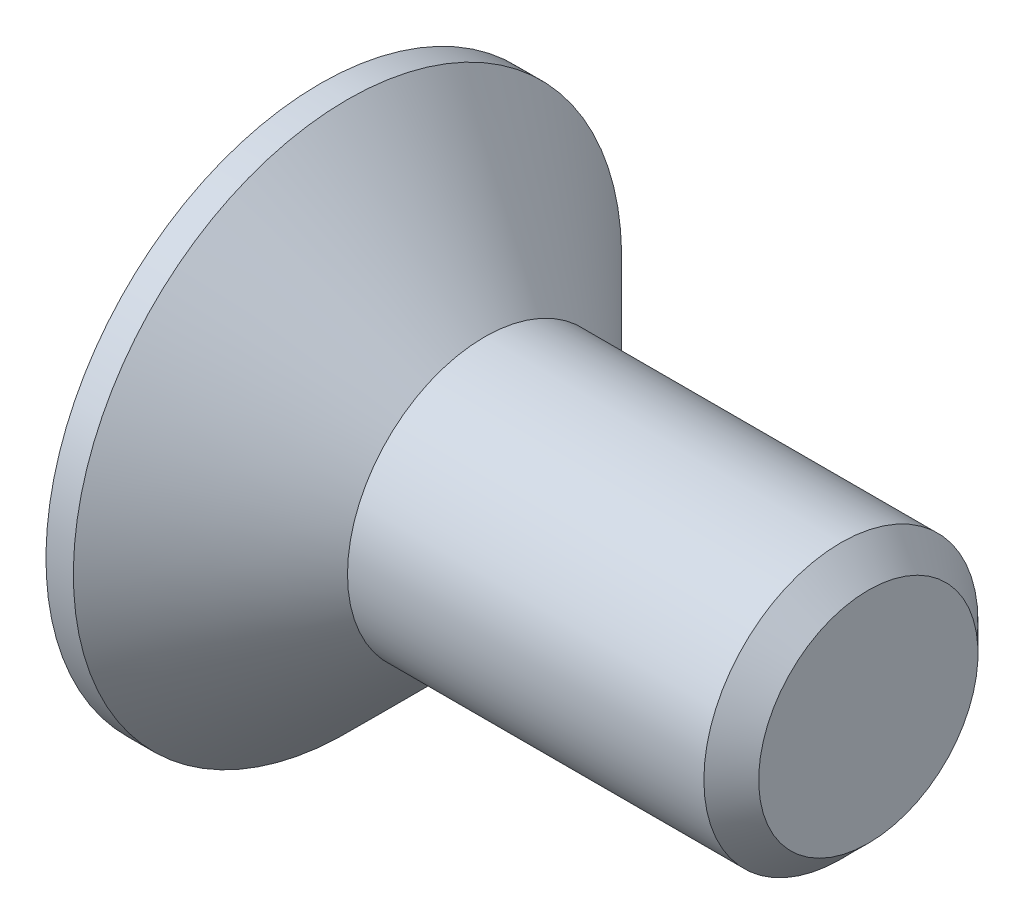
ISO-10303-21;
HEADER;
FILE_DESCRIPTION(('STEP AP214'),'2;1');
FILE_NAME('part.step','',(''),(''),'','','');
FILE_SCHEMA(('AUTOMOTIVE_DESIGN { 1 0 10303 214 1 1 1 1 }'));
ENDSEC;
DATA;
#1=APPLICATION_CONTEXT('core data for automotive mechanical design processes');
#2=APPLICATION_PROTOCOL_DEFINITION('international standard','automotive_design',2000,#1);
#3=PRODUCT_CONTEXT('',#1,'mechanical');
#4=PRODUCT('Part','Part','',(#3));
#5=PRODUCT_RELATED_PRODUCT_CATEGORY('part','',(#4));
#6=PRODUCT_DEFINITION_FORMATION('','',#4);
#7=PRODUCT_DEFINITION_CONTEXT('part definition',#1,'design');
#8=PRODUCT_DEFINITION('design','',#6,#7);
#9=PRODUCT_DEFINITION_SHAPE('','',#8);
#10=(LENGTH_UNIT() NAMED_UNIT(*) SI_UNIT(.MILLI.,.METRE.));
#11=(NAMED_UNIT(*) PLANE_ANGLE_UNIT() SI_UNIT($,.RADIAN.));
#12=(NAMED_UNIT(*) SI_UNIT($,.STERADIAN.) SOLID_ANGLE_UNIT());
#13=UNCERTAINTY_MEASURE_WITH_UNIT(LENGTH_MEASURE(1.E-05),#10,'distance_accuracy_value','');
#14=(GEOMETRIC_REPRESENTATION_CONTEXT(3) GLOBAL_UNCERTAINTY_ASSIGNED_CONTEXT((#13)) GLOBAL_UNIT_ASSIGNED_CONTEXT((#10,
#11,#12)) REPRESENTATION_CONTEXT('',''));
#15=CARTESIAN_POINT('',(0.,0.,0.));
#16=DIRECTION('',(0.,0.,1.));
#17=DIRECTION('',(1.,0.,0.));
#18=AXIS2_PLACEMENT_3D('',#15,#16,#17);
#19=CARTESIAN_POINT('',(0.,0.,0.));
#20=DIRECTION('',(-1.,0.,0.));
#21=DIRECTION('',(0.,-1.,0.));
#22=AXIS2_PLACEMENT_3D('',#19,#20,#21);
#23=PLANE('',#22);
#24=DIRECTION('',(0.,0.5,-0.866025403784439));
#25=VECTOR('',#24,1.);
#26=CARTESIAN_POINT('',(0.,0.866025403784439,1.5));
#27=LINE('',#26,#25);
#28=CARTESIAN_POINT('',(0.,0.866025403784439,1.5));
#29=VERTEX_POINT('',#28);
#30=CARTESIAN_POINT('',(0.,1.73205080756888,0.));
#31=VERTEX_POINT('',#30);
#32=EDGE_CURVE('E48',#29,#31,#27,.T.);
#33=ORIENTED_EDGE('',*,*,#32,.F.);
#34=DIRECTION('',(0.,1.,0.));
#35=VECTOR('',#34,1.);
#36=CARTESIAN_POINT('',(0.,-0.86602540378444,1.5));
#37=LINE('',#36,#35);
#38=CARTESIAN_POINT('',(0.,-0.86602540378444,1.5));
#39=VERTEX_POINT('',#38);
#40=EDGE_CURVE('E131',#39,#29,#37,.T.);
#41=ORIENTED_EDGE('',*,*,#40,.F.);
#42=DIRECTION('',(0.,0.5,0.866025403784439));
#43=VECTOR('',#42,1.);
#44=CARTESIAN_POINT('',(0.,-1.73205080756888,0.));
#45=LINE('',#44,#43);
#46=CARTESIAN_POINT('',(0.,-1.73205080756888,0.));
#47=VERTEX_POINT('',#46);
#48=EDGE_CURVE('E129',#47,#39,#45,.T.);
#49=ORIENTED_EDGE('',*,*,#48,.F.);
#50=DIRECTION('',(0.,-0.5,0.866025403784438));
#51=VECTOR('',#50,1.);
#52=CARTESIAN_POINT('',(0.,-0.866025403784439,-1.5));
#53=LINE('',#52,#51);
#54=CARTESIAN_POINT('',(0.,-0.866025403784439,-1.5));
#55=VERTEX_POINT('',#54);
#56=EDGE_CURVE('E96',#55,#47,#53,.T.);
#57=ORIENTED_EDGE('',*,*,#56,.F.);
#58=DIRECTION('',(0.,-1.,0.));
#59=VECTOR('',#58,1.);
#60=CARTESIAN_POINT('',(0.,0.866025403784439,-1.5));
#61=LINE('',#60,#59);
#62=CARTESIAN_POINT('',(0.,0.866025403784439,-1.5));
#63=VERTEX_POINT('',#62);
#64=EDGE_CURVE('E125',#63,#55,#61,.T.);
#65=ORIENTED_EDGE('',*,*,#64,.F.);
#66=DIRECTION('',(0.,-0.5,-0.866025403784439));
#67=VECTOR('',#66,1.);
#68=CARTESIAN_POINT('',(0.,1.73205080756888,0.));
#69=LINE('',#68,#67);
#70=EDGE_CURVE('E122',#31,#63,#69,.T.);
#71=ORIENTED_EDGE('',*,*,#70,.F.);
#72=EDGE_LOOP('',(#33,#41,#49,#57,#65,#71));
#73=FACE_BOUND('',#72,.T.);
#74=CARTESIAN_POINT('',(0.,0.,0.));
#75=DIRECTION('',(1.,0.,0.));
#76=DIRECTION('',(0.,1.,0.));
#77=AXIS2_PLACEMENT_3D('',#74,#75,#76);
#78=CIRCLE('',#77,5.);
#79=CARTESIAN_POINT('',(0.,5.,0.));
#80=VERTEX_POINT('',#79);
#81=EDGE_CURVE('E146',#80,#80,#78,.T.);
#82=ORIENTED_EDGE('',*,*,#81,.F.);
#83=EDGE_LOOP('',(#82));
#84=FACE_BOUND('',#83,.T.);
#85=ADVANCED_FACE('F33',(#73,#84),#23,.T.);
#86=CARTESIAN_POINT('',(10.,0.,0.));
#87=DIRECTION('',(1.,0.,0.));
#88=DIRECTION('',(0.,1.,0.));
#89=AXIS2_PLACEMENT_3D('',#86,#87,#88);
#90=CYLINDRICAL_SURFACE('',#89,5.);
#91=ORIENTED_EDGE('',*,*,#81,.T.);
#92=EDGE_LOOP('',(#91));
#93=FACE_BOUND('',#92,.T.);
#94=CARTESIAN_POINT('',(0.499999999999938,0.,0.));
#95=DIRECTION('',(1.,0.,0.));
#96=DIRECTION('',(0.,1.,0.));
#97=AXIS2_PLACEMENT_3D('',#94,#95,#96);
#98=CIRCLE('',#97,5.);
#99=CARTESIAN_POINT('',(0.49999999999994,5.,0.));
#100=VERTEX_POINT('',#99);
#101=EDGE_CURVE('E143',#100,#100,#98,.T.);
#102=ORIENTED_EDGE('',*,*,#101,.F.);
#103=EDGE_LOOP('',(#102));
#104=FACE_BOUND('',#103,.T.);
#105=ADVANCED_FACE('F166',(#93,#104),#90,.T.);
#106=CARTESIAN_POINT('',(3.,0.,0.));
#107=DIRECTION('',(-1.,0.,0.));
#108=DIRECTION('',(0.,-1.,0.));
#109=AXIS2_PLACEMENT_3D('',#106,#107,#108);
#110=CONICAL_SURFACE('',#109,2.5,0.785398163397436);
#111=ORIENTED_EDGE('',*,*,#101,.T.);
#112=EDGE_LOOP('',(#111));
#113=FACE_BOUND('',#112,.T.);
#114=CARTESIAN_POINT('',(3.,0.,0.));
#115=DIRECTION('',(1.,0.,0.));
#116=DIRECTION('',(0.,1.,0.));
#117=AXIS2_PLACEMENT_3D('',#114,#115,#116);
#118=CIRCLE('',#117,2.5);
#119=CARTESIAN_POINT('',(3.,2.5,0.));
#120=VERTEX_POINT('',#119);
#121=EDGE_CURVE('E135',#120,#120,#118,.T.);
#122=ORIENTED_EDGE('',*,*,#121,.F.);
#123=EDGE_LOOP('',(#122));
#124=FACE_BOUND('',#123,.T.);
#125=ADVANCED_FACE('F171',(#113,#124),#110,.T.);
#126=CARTESIAN_POINT('',(10.,0.,0.));
#127=DIRECTION('',(1.,0.,0.));
#128=DIRECTION('',(0.,1.,0.));
#129=AXIS2_PLACEMENT_3D('',#126,#127,#128);
#130=CYLINDRICAL_SURFACE('',#129,2.5);
#131=CARTESIAN_POINT('',(9.5,0.,0.));
#132=DIRECTION('',(1.,0.,0.));
#133=DIRECTION('',(0.,1.,0.));
#134=AXIS2_PLACEMENT_3D('',#131,#132,#133);
#135=CIRCLE('',#134,2.5);
#136=CARTESIAN_POINT('',(9.5,2.5,0.));
#137=VERTEX_POINT('',#136);
#138=EDGE_CURVE('E11',#137,#137,#135,.F.);
#139=ORIENTED_EDGE('',*,*,#138,.T.);
#140=EDGE_LOOP('',(#139));
#141=FACE_BOUND('',#140,.T.);
#142=ORIENTED_EDGE('',*,*,#121,.T.);
#143=EDGE_LOOP('',(#142));
#144=FACE_BOUND('',#143,.T.);
#145=ADVANCED_FACE('F162',(#141,#144),#130,.T.);
#146=CARTESIAN_POINT('',(10.,2.5,0.));
#147=DIRECTION('',(1.,0.,0.));
#148=DIRECTION('',(0.,1.,0.));
#149=AXIS2_PLACEMENT_3D('',#146,#147,#148);
#150=PLANE('',#149);
#151=CARTESIAN_POINT('',(10.,0.,0.));
#152=DIRECTION('',(1.,0.,0.));
#153=DIRECTION('',(0.,1.,0.));
#154=AXIS2_PLACEMENT_3D('',#151,#152,#153);
#155=CIRCLE('',#154,1.99999999999999);
#156=CARTESIAN_POINT('',(10.,1.99999999999999,0.));
#157=VERTEX_POINT('',#156);
#158=EDGE_CURVE('E41',#157,#157,#155,.T.);
#159=ORIENTED_EDGE('',*,*,#158,.T.);
#160=EDGE_LOOP('',(#159));
#161=FACE_BOUND('',#160,.T.);
#162=ADVANCED_FACE('F151',(#161),#150,.T.);
#163=CARTESIAN_POINT('',(10.,0.,0.));
#164=DIRECTION('',(-1.,0.,0.));
#165=DIRECTION('',(0.,-1.,0.));
#166=AXIS2_PLACEMENT_3D('',#163,#164,#165);
#167=CONICAL_SURFACE('',#166,1.99999999999999,0.785398163397448);
#168=ORIENTED_EDGE('',*,*,#138,.F.);
#169=EDGE_LOOP('',(#168));
#170=FACE_BOUND('',#169,.T.);
#171=ORIENTED_EDGE('',*,*,#158,.F.);
#172=EDGE_LOOP('',(#171));
#173=FACE_BOUND('',#172,.T.);
#174=ADVANCED_FACE('F35',(#170,#173),#167,.T.);
#175=CARTESIAN_POINT('',(2.3,0.866025403784438,1.5));
#176=DIRECTION('',(0.,0.866025403784439,0.5));
#177=DIRECTION('',(0.,-0.5,0.866025403784439));
#178=AXIS2_PLACEMENT_3D('',#175,#176,#177);
#179=PLANE('',#178);
#180=ORIENTED_EDGE('',*,*,#32,.T.);
#181=DIRECTION('',(-1.,0.,0.));
#182=VECTOR('',#181,1.);
#183=CARTESIAN_POINT('',(2.3,1.73205080756888,0.));
#184=LINE('',#183,#182);
#185=CARTESIAN_POINT('',(2.3,1.73205080756888,0.));
#186=VERTEX_POINT('',#185);
#187=EDGE_CURVE('E78',#186,#31,#184,.T.);
#188=ORIENTED_EDGE('',*,*,#187,.F.);
#189=DIRECTION('',(0.,0.5,-0.866025403784439));
#190=VECTOR('',#189,1.);
#191=CARTESIAN_POINT('',(2.3,0.866025403784438,1.5));
#192=LINE('',#191,#190);
#193=CARTESIAN_POINT('',(2.3,0.866025403784438,1.5));
#194=VERTEX_POINT('',#193);
#195=EDGE_CURVE('E133',#194,#186,#192,.T.);
#196=ORIENTED_EDGE('',*,*,#195,.F.);
#197=DIRECTION('',(-1.,0.,0.));
#198=VECTOR('',#197,1.);
#199=CARTESIAN_POINT('',(2.3,0.866025403784438,1.5));
#200=LINE('',#199,#198);
#201=EDGE_CURVE('E56',#194,#29,#200,.T.);
#202=ORIENTED_EDGE('',*,*,#201,.T.);
#203=EDGE_LOOP('',(#180,#188,#196,#202));
#204=FACE_BOUND('',#203,.T.);
#205=ADVANCED_FACE('F154',(#204),#179,.F.);
#206=CARTESIAN_POINT('',(2.3,-0.86602540378444,1.5));
#207=DIRECTION('',(0.,0.,1.));
#208=DIRECTION('',(0.,-1.,0.));
#209=AXIS2_PLACEMENT_3D('',#206,#207,#208);
#210=PLANE('',#209);
#211=ORIENTED_EDGE('',*,*,#40,.T.);
#212=ORIENTED_EDGE('',*,*,#201,.F.);
#213=DIRECTION('',(0.,1.,0.));
#214=VECTOR('',#213,1.);
#215=CARTESIAN_POINT('',(2.3,-0.86602540378444,1.5));
#216=LINE('',#215,#214);
#217=CARTESIAN_POINT('',(2.3,-0.86602540378444,1.5));
#218=VERTEX_POINT('',#217);
#219=EDGE_CURVE('E108',#218,#194,#216,.T.);
#220=ORIENTED_EDGE('',*,*,#219,.F.);
#221=DIRECTION('',(-1.,0.,0.));
#222=VECTOR('',#221,1.);
#223=CARTESIAN_POINT('',(2.3,-0.86602540378444,1.5));
#224=LINE('',#223,#222);
#225=EDGE_CURVE('E100',#218,#39,#224,.T.);
#226=ORIENTED_EDGE('',*,*,#225,.T.);
#227=EDGE_LOOP('',(#211,#212,#220,#226));
#228=FACE_BOUND('',#227,.T.);
#229=ADVANCED_FACE('F160',(#228),#210,.F.);
#230=CARTESIAN_POINT('',(2.3,-1.73205080756888,0.));
#231=DIRECTION('',(0.,-0.866025403784439,0.5));
#232=DIRECTION('',(0.,-0.5,-0.866025403784439));
#233=AXIS2_PLACEMENT_3D('',#230,#231,#232);
#234=PLANE('',#233);
#235=ORIENTED_EDGE('',*,*,#48,.T.);
#236=ORIENTED_EDGE('',*,*,#225,.F.);
#237=DIRECTION('',(0.,0.5,0.866025403784439));
#238=VECTOR('',#237,1.);
#239=CARTESIAN_POINT('',(2.3,-1.73205080756888,0.));
#240=LINE('',#239,#238);
#241=CARTESIAN_POINT('',(2.3,-1.73205080756888,0.));
#242=VERTEX_POINT('',#241);
#243=EDGE_CURVE('E104',#242,#218,#240,.T.);
#244=ORIENTED_EDGE('',*,*,#243,.F.);
#245=DIRECTION('',(-1.,0.,0.));
#246=VECTOR('',#245,1.);
#247=CARTESIAN_POINT('',(2.3,-1.73205080756888,0.));
#248=LINE('',#247,#246);
#249=EDGE_CURVE('E89',#242,#47,#248,.T.);
#250=ORIENTED_EDGE('',*,*,#249,.T.);
#251=EDGE_LOOP('',(#235,#236,#244,#250));
#252=FACE_BOUND('',#251,.T.);
#253=ADVANCED_FACE('F105',(#252),#234,.F.);
#254=CARTESIAN_POINT('',(2.3,-0.866025403784439,-1.5));
#255=DIRECTION('',(0.,-0.866025403784439,-0.5));
#256=DIRECTION('',(0.,0.5,-0.866025403784439));
#257=AXIS2_PLACEMENT_3D('',#254,#255,#256);
#258=PLANE('',#257);
#259=ORIENTED_EDGE('',*,*,#56,.T.);
#260=ORIENTED_EDGE('',*,*,#249,.F.);
#261=DIRECTION('',(0.,-0.5,0.866025403784438));
#262=VECTOR('',#261,1.);
#263=CARTESIAN_POINT('',(2.3,-0.866025403784439,-1.5));
#264=LINE('',#263,#262);
#265=CARTESIAN_POINT('',(2.3,-0.866025403784439,-1.5));
#266=VERTEX_POINT('',#265);
#267=EDGE_CURVE('E93',#266,#242,#264,.T.);
#268=ORIENTED_EDGE('',*,*,#267,.F.);
#269=DIRECTION('',(-1.,0.,0.));
#270=VECTOR('',#269,1.);
#271=CARTESIAN_POINT('',(2.3,-0.866025403784439,-1.5));
#272=LINE('',#271,#270);
#273=EDGE_CURVE('E101',#266,#55,#272,.T.);
#274=ORIENTED_EDGE('',*,*,#273,.T.);
#275=EDGE_LOOP('',(#259,#260,#268,#274));
#276=FACE_BOUND('',#275,.T.);
#277=ADVANCED_FACE('F91',(#276),#258,.F.);
#278=CARTESIAN_POINT('',(2.3,0.866025403784438,-1.5));
#279=DIRECTION('',(0.,0.,-1.));
#280=DIRECTION('',(-1.,0.,0.));
#281=AXIS2_PLACEMENT_3D('',#278,#279,#280);
#282=PLANE('',#281);
#283=ORIENTED_EDGE('',*,*,#64,.T.);
#284=ORIENTED_EDGE('',*,*,#273,.F.);
#285=DIRECTION('',(0.,-1.,0.));
#286=VECTOR('',#285,1.);
#287=CARTESIAN_POINT('',(2.3,0.866025403784438,-1.5));
#288=LINE('',#287,#286);
#289=CARTESIAN_POINT('',(2.3,0.866025403784438,-1.5));
#290=VERTEX_POINT('',#289);
#291=EDGE_CURVE('E114',#290,#266,#288,.T.);
#292=ORIENTED_EDGE('',*,*,#291,.F.);
#293=DIRECTION('',(-1.,0.,0.));
#294=VECTOR('',#293,1.);
#295=CARTESIAN_POINT('',(2.3,0.866025403784438,-1.5));
#296=LINE('',#295,#294);
#297=EDGE_CURVE('E138',#290,#63,#296,.T.);
#298=ORIENTED_EDGE('',*,*,#297,.T.);
#299=EDGE_LOOP('',(#283,#284,#292,#298));
#300=FACE_BOUND('',#299,.T.);
#301=ADVANCED_FACE('F185',(#300),#282,.F.);
#302=CARTESIAN_POINT('',(2.3,1.73205080756888,0.));
#303=DIRECTION('',(0.,0.866025403784439,-0.5));
#304=DIRECTION('',(0.,0.5,0.866025403784439));
#305=AXIS2_PLACEMENT_3D('',#302,#303,#304);
#306=PLANE('',#305);
#307=ORIENTED_EDGE('',*,*,#70,.T.);
#308=ORIENTED_EDGE('',*,*,#297,.F.);
#309=DIRECTION('',(0.,-0.5,-0.866025403784439));
#310=VECTOR('',#309,1.);
#311=CARTESIAN_POINT('',(2.3,1.73205080756888,0.));
#312=LINE('',#311,#310);
#313=EDGE_CURVE('E116',#186,#290,#312,.T.);
#314=ORIENTED_EDGE('',*,*,#313,.F.);
#315=ORIENTED_EDGE('',*,*,#187,.T.);
#316=EDGE_LOOP('',(#307,#308,#314,#315));
#317=FACE_BOUND('',#316,.T.);
#318=ADVANCED_FACE('F182',(#317),#306,.F.);
#319=CARTESIAN_POINT('',(2.3,0.,0.));
#320=DIRECTION('',(-1.,0.,0.));
#321=DIRECTION('',(0.,-1.,0.));
#322=AXIS2_PLACEMENT_3D('',#319,#320,#321);
#323=PLANE('',#322);
#324=ORIENTED_EDGE('',*,*,#195,.T.);
#325=ORIENTED_EDGE('',*,*,#313,.T.);
#326=ORIENTED_EDGE('',*,*,#291,.T.);
#327=ORIENTED_EDGE('',*,*,#267,.T.);
#328=ORIENTED_EDGE('',*,*,#243,.T.);
#329=ORIENTED_EDGE('',*,*,#219,.T.);
#330=EDGE_LOOP('',(#324,#325,#326,#327,#328,#329));
#331=FACE_BOUND('',#330,.T.);
#332=ADVANCED_FACE('F111',(#331),#323,.T.);
#333=CLOSED_SHELL('',(#85,#105,#125,#145,#162,#174,#205,#229,#253,#277,#301,#318,#332));
#334=MANIFOLD_SOLID_BREP('B2',#333);
#335=ADVANCED_BREP_SHAPE_REPRESENTATION('',(#18,#334),#14);
#336=SHAPE_DEFINITION_REPRESENTATION(#9,#335);
ENDSEC;
END-ISO-10303-21;
